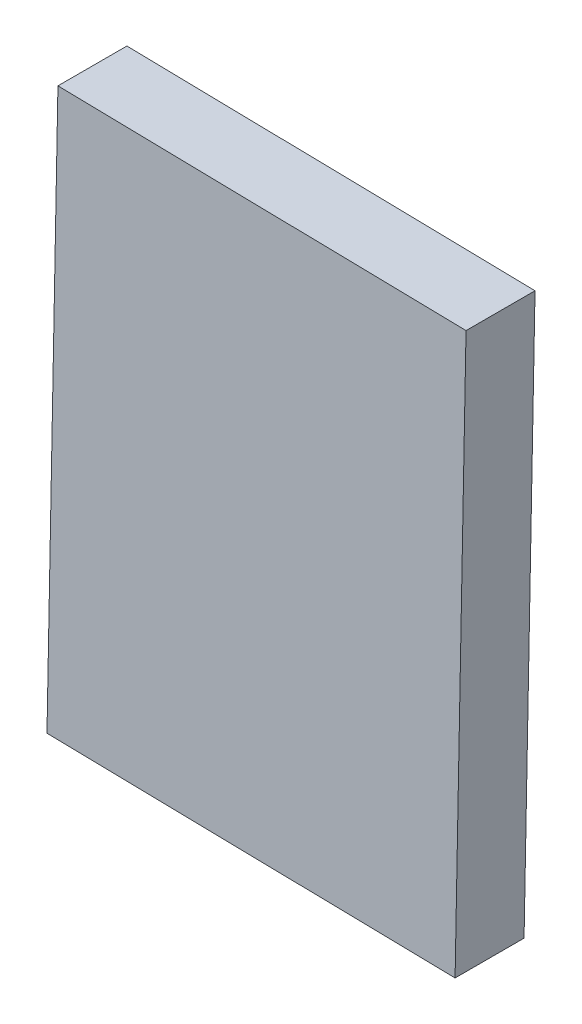
ISO-10303-21;
HEADER;
FILE_DESCRIPTION(('STEP AP214'),'2;1');
FILE_NAME('part.step','',(''),(''),'','','');
FILE_SCHEMA(('AUTOMOTIVE_DESIGN { 1 0 10303 214 1 1 1 1 }'));
ENDSEC;
DATA;
#1=APPLICATION_CONTEXT('core data for automotive mechanical design processes');
#2=APPLICATION_PROTOCOL_DEFINITION('international standard','automotive_design',2000,#1);
#3=PRODUCT_CONTEXT('',#1,'mechanical');
#4=PRODUCT('Part','Part','',(#3));
#5=PRODUCT_RELATED_PRODUCT_CATEGORY('part','',(#4));
#6=PRODUCT_DEFINITION_FORMATION('','',#4);
#7=PRODUCT_DEFINITION_CONTEXT('part definition',#1,'design');
#8=PRODUCT_DEFINITION('design','',#6,#7);
#9=PRODUCT_DEFINITION_SHAPE('','',#8);
#10=(LENGTH_UNIT() NAMED_UNIT(*) SI_UNIT(.MILLI.,.METRE.));
#11=(NAMED_UNIT(*) PLANE_ANGLE_UNIT() SI_UNIT($,.RADIAN.));
#12=(NAMED_UNIT(*) SI_UNIT($,.STERADIAN.) SOLID_ANGLE_UNIT());
#13=UNCERTAINTY_MEASURE_WITH_UNIT(LENGTH_MEASURE(1.E-05),#10,'distance_accuracy_value','');
#14=(GEOMETRIC_REPRESENTATION_CONTEXT(3) GLOBAL_UNCERTAINTY_ASSIGNED_CONTEXT((#13)) GLOBAL_UNIT_ASSIGNED_CONTEXT((#10,
#11,#12)) REPRESENTATION_CONTEXT('',''));
#15=CARTESIAN_POINT('',(0.,0.,0.));
#16=DIRECTION('',(0.,0.,1.));
#17=DIRECTION('',(1.,0.,0.));
#18=AXIS2_PLACEMENT_3D('',#15,#16,#17);
#19=CARTESIAN_POINT('',(-1.69169808418193,1.84838383607335,34.7010965279299));
#20=DIRECTION('',(0.,0.,1.));
#21=DIRECTION('',(0.999812677663925,-0.0193548335692301,0.));
#22=AXIS2_PLACEMENT_3D('',#19,#20,#21);
#23=PLANE('',#22);
#24=DIRECTION('',(0.0193548335692301,0.999812677663925,0.));
#25=VECTOR('',#24,1.);
#26=CARTESIAN_POINT('',(-10.9491282892118,-10.4842503208698,34.7010965279297));
#27=LINE('',#26,#25);
#28=CARTESIAN_POINT('',(-10.9491282892118,-10.4842503208698,34.7010965279297));
#29=VERTEX_POINT('',#28);
#30=CARTESIAN_POINT('',(-10.4648897081432,14.530063061604,34.7010965279294));
#31=VERTEX_POINT('',#30);
#32=EDGE_CURVE('E58',#29,#31,#27,.T.);
#33=ORIENTED_EDGE('',*,*,#32,.T.);
#34=DIRECTION('',(0.999812677663925,-0.0193548335692299,0.));
#35=VECTOR('',#34,1.);
#36=CARTESIAN_POINT('',(-10.4648897081432,14.530063061604,34.7010965279294));
#37=LINE('',#36,#35);
#38=CARTESIAN_POINT('',(7.56573212084797,14.1810179930165,34.70109652793));
#39=VERTEX_POINT('',#38);
#40=EDGE_CURVE('E20',#31,#39,#37,.T.);
#41=ORIENTED_EDGE('',*,*,#40,.T.);
#42=DIRECTION('',(-0.0193548335692301,-0.999812677663925,0.));
#43=VECTOR('',#42,1.);
#44=CARTESIAN_POINT('',(7.0814935397794,-10.8332953894573,34.7010965279303));
#45=LINE('',#44,#43);
#46=CARTESIAN_POINT('',(7.0814935397794,-10.8332953894573,34.7010965279303));
#47=VERTEX_POINT('',#46);
#48=EDGE_CURVE('E89',#39,#47,#45,.T.);
#49=ORIENTED_EDGE('',*,*,#48,.T.);
#50=DIRECTION('',(-0.999812677663925,0.0193548335692299,0.));
#51=VECTOR('',#50,1.);
#52=CARTESIAN_POINT('',(-10.9491282892118,-10.4842503208698,34.7010965279297));
#53=LINE('',#52,#51);
#54=EDGE_CURVE('E56',#47,#29,#53,.T.);
#55=ORIENTED_EDGE('',*,*,#54,.T.);
#56=EDGE_LOOP('',(#33,#41,#49,#55));
#57=FACE_BOUND('',#56,.T.);
#58=ADVANCED_FACE('F17',(#57),#23,.F.);
#59=CARTESIAN_POINT('',(-10.4648897081433,14.530063061604,37.7490965279294));
#60=DIRECTION('',(-0.0193548335692299,-0.999812677663925,0.));
#61=DIRECTION('',(0.999812677663925,-0.0193548335692299,0.));
#62=AXIS2_PLACEMENT_3D('',#59,#60,#61);
#63=PLANE('',#62);
#64=DIRECTION('',(0.,0.,1.));
#65=VECTOR('',#64,1.);
#66=CARTESIAN_POINT('',(7.56573212084787,14.1810179930165,37.74909652793));
#67=LINE('',#66,#65);
#68=CARTESIAN_POINT('',(7.56573212084787,14.1810179930165,37.74909652793));
#69=VERTEX_POINT('',#68);
#70=EDGE_CURVE('E70',#69,#39,#67,.F.);
#71=ORIENTED_EDGE('',*,*,#70,.T.);
#72=ORIENTED_EDGE('',*,*,#40,.F.);
#73=DIRECTION('',(0.,0.,1.));
#74=VECTOR('',#73,1.);
#75=CARTESIAN_POINT('',(-10.4648897081433,14.530063061604,37.7490965279294));
#76=LINE('',#75,#74);
#77=CARTESIAN_POINT('',(-10.4648897081433,14.530063061604,37.7490965279294));
#78=VERTEX_POINT('',#77);
#79=EDGE_CURVE('E65',#31,#78,#76,.T.);
#80=ORIENTED_EDGE('',*,*,#79,.T.);
#81=DIRECTION('',(0.999812677663925,-0.0193548335692301,0.));
#82=VECTOR('',#81,1.);
#83=CARTESIAN_POINT('',(-1.44957879364774,14.3555405273103,37.7490965279297));
#84=LINE('',#83,#82);
#85=EDGE_CURVE('E93',#69,#78,#84,.F.);
#86=ORIENTED_EDGE('',*,*,#85,.F.);
#87=EDGE_LOOP('',(#71,#72,#80,#86));
#88=FACE_BOUND('',#87,.T.);
#89=ADVANCED_FACE('F67',(#88),#63,.F.);
#90=CARTESIAN_POINT('',(-10.9491282892119,-10.4842503208697,37.7490965279298));
#91=DIRECTION('',(0.999812677663925,-0.0193548335692301,0.));
#92=DIRECTION('',(0.0193548335692301,0.999812677663925,0.));
#93=AXIS2_PLACEMENT_3D('',#90,#91,#92);
#94=PLANE('',#93);
#95=ORIENTED_EDGE('',*,*,#79,.F.);
#96=ORIENTED_EDGE('',*,*,#32,.F.);
#97=DIRECTION('',(0.,0.,1.));
#98=VECTOR('',#97,1.);
#99=CARTESIAN_POINT('',(-10.9491282892119,-10.4842503208697,37.7490965279298));
#100=LINE('',#99,#98);
#101=CARTESIAN_POINT('',(-10.9491282892119,-10.4842503208697,37.7490965279298));
#102=VERTEX_POINT('',#101);
#103=EDGE_CURVE('E82',#29,#102,#100,.T.);
#104=ORIENTED_EDGE('',*,*,#103,.T.);
#105=DIRECTION('',(0.0193548335692301,0.999812677663925,0.));
#106=VECTOR('',#105,1.);
#107=CARTESIAN_POINT('',(-10.7070089986776,2.02290637036714,37.7490965279296));
#108=LINE('',#107,#106);
#109=EDGE_CURVE('E75',#78,#102,#108,.F.);
#110=ORIENTED_EDGE('',*,*,#109,.F.);
#111=EDGE_LOOP('',(#95,#96,#104,#110));
#112=FACE_BOUND('',#111,.T.);
#113=ADVANCED_FACE('F73',(#112),#94,.F.);
#114=CARTESIAN_POINT('',(-10.9491282892119,-10.4842503208697,37.7490965279298));
#115=DIRECTION('',(0.0193548335692299,0.999812677663925,0.));
#116=DIRECTION('',(-0.999812677663925,0.0193548335692299,0.));
#117=AXIS2_PLACEMENT_3D('',#114,#115,#116);
#118=PLANE('',#117);
#119=ORIENTED_EDGE('',*,*,#103,.F.);
#120=ORIENTED_EDGE('',*,*,#54,.F.);
#121=DIRECTION('',(0.,0.,1.));
#122=VECTOR('',#121,1.);
#123=CARTESIAN_POINT('',(7.0814935397793,-10.8332953894572,37.7490965279303));
#124=LINE('',#123,#122);
#125=CARTESIAN_POINT('',(7.0814935397793,-10.8332953894572,37.7490965279303));
#126=VERTEX_POINT('',#125);
#127=EDGE_CURVE('E36',#47,#126,#124,.T.);
#128=ORIENTED_EDGE('',*,*,#127,.T.);
#129=DIRECTION('',(0.999812677663925,-0.0193548335692301,0.));
#130=VECTOR('',#129,1.);
#131=CARTESIAN_POINT('',(-1.93381737471631,-10.6587728551635,37.74909652793));
#132=LINE('',#131,#130);
#133=EDGE_CURVE('E27',#102,#126,#132,.T.);
#134=ORIENTED_EDGE('',*,*,#133,.F.);
#135=EDGE_LOOP('',(#119,#120,#128,#134));
#136=FACE_BOUND('',#135,.T.);
#137=ADVANCED_FACE('F102',(#136),#118,.F.);
#138=CARTESIAN_POINT('',(7.0814935397793,-10.8332953894572,37.7490965279303));
#139=DIRECTION('',(-0.999812677663925,0.0193548335692301,0.));
#140=DIRECTION('',(-0.0193548335692301,-0.999812677663925,0.));
#141=AXIS2_PLACEMENT_3D('',#138,#139,#140);
#142=PLANE('',#141);
#143=ORIENTED_EDGE('',*,*,#127,.F.);
#144=ORIENTED_EDGE('',*,*,#48,.F.);
#145=ORIENTED_EDGE('',*,*,#70,.F.);
#146=DIRECTION('',(0.0193548335692301,0.999812677663925,0.));
#147=VECTOR('',#146,1.);
#148=CARTESIAN_POINT('',(7.32361283031359,1.67386130177965,37.7490965279302));
#149=LINE('',#148,#147);
#150=EDGE_CURVE('E11',#126,#69,#149,.T.);
#151=ORIENTED_EDGE('',*,*,#150,.F.);
#152=EDGE_LOOP('',(#143,#144,#145,#151));
#153=FACE_BOUND('',#152,.T.);
#154=ADVANCED_FACE('F104',(#153),#142,.F.);
#155=CARTESIAN_POINT('',(-1.69169808418203,1.8483838360734,37.7490965279299));
#156=DIRECTION('',(0.,0.,1.));
#157=DIRECTION('',(0.999812677663925,-0.0193548335692301,0.));
#158=AXIS2_PLACEMENT_3D('',#155,#156,#157);
#159=PLANE('',#158);
#160=ORIENTED_EDGE('',*,*,#133,.T.);
#161=ORIENTED_EDGE('',*,*,#150,.T.);
#162=ORIENTED_EDGE('',*,*,#85,.T.);
#163=ORIENTED_EDGE('',*,*,#109,.T.);
#164=EDGE_LOOP('',(#160,#161,#162,#163));
#165=FACE_BOUND('',#164,.T.);
#166=ADVANCED_FACE('F101',(#165),#159,.T.);
#167=CLOSED_SHELL('',(#58,#89,#113,#137,#154,#166));
#168=MANIFOLD_SOLID_BREP('B1',#167);
#169=ADVANCED_BREP_SHAPE_REPRESENTATION('',(#18,#168),#14);
#170=SHAPE_DEFINITION_REPRESENTATION(#9,#169);
ENDSEC;
END-ISO-10303-21;
